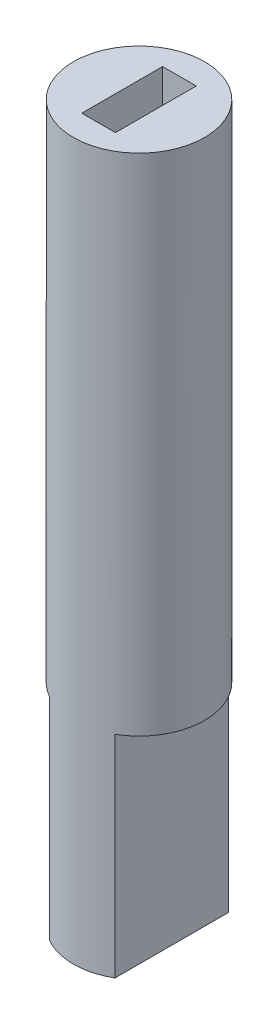
ISO-10303-21;
HEADER;
FILE_DESCRIPTION(('STEP AP214'),'2;1');
FILE_NAME('part.step','',(''),(''),'','','');
FILE_SCHEMA(('AUTOMOTIVE_DESIGN { 1 0 10303 214 1 1 1 1 }'));
ENDSEC;
DATA;
#1=APPLICATION_CONTEXT('core data for automotive mechanical design processes');
#2=APPLICATION_PROTOCOL_DEFINITION('international standard','automotive_design',2000,#1);
#3=PRODUCT_CONTEXT('',#1,'mechanical');
#4=PRODUCT('Part','Part','',(#3));
#5=PRODUCT_RELATED_PRODUCT_CATEGORY('part','',(#4));
#6=PRODUCT_DEFINITION_FORMATION('','',#4);
#7=PRODUCT_DEFINITION_CONTEXT('part definition',#1,'design');
#8=PRODUCT_DEFINITION('design','',#6,#7);
#9=PRODUCT_DEFINITION_SHAPE('','',#8);
#10=(LENGTH_UNIT() NAMED_UNIT(*) SI_UNIT(.MILLI.,.METRE.));
#11=(NAMED_UNIT(*) PLANE_ANGLE_UNIT() SI_UNIT($,.RADIAN.));
#12=(NAMED_UNIT(*) SI_UNIT($,.STERADIAN.) SOLID_ANGLE_UNIT());
#13=UNCERTAINTY_MEASURE_WITH_UNIT(LENGTH_MEASURE(1.E-05),#10,'distance_accuracy_value','');
#14=(GEOMETRIC_REPRESENTATION_CONTEXT(3) GLOBAL_UNCERTAINTY_ASSIGNED_CONTEXT((#13)) GLOBAL_UNIT_ASSIGNED_CONTEXT((#10,
#11,#12)) REPRESENTATION_CONTEXT('',''));
#15=CARTESIAN_POINT('',(0.,0.,0.));
#16=DIRECTION('',(0.,0.,1.));
#17=DIRECTION('',(1.,0.,0.));
#18=AXIS2_PLACEMENT_3D('',#15,#16,#17);
#19=CARTESIAN_POINT('',(0.,130.1,0.));
#20=DIRECTION('',(0.,1.,0.));
#21=DIRECTION('',(0.,0.,1.));
#22=AXIS2_PLACEMENT_3D('',#19,#20,#21);
#23=PLANE('',#22);
#24=DIRECTION('',(0.,0.,-1.));
#25=VECTOR('',#24,1.);
#26=CARTESIAN_POINT('',(-0.5000000000001,130.1,48.8000000000001));
#27=LINE('',#26,#25);
#28=CARTESIAN_POINT('',(-0.500000000000099,130.1,51.2000000000001));
#29=VERTEX_POINT('',#28);
#30=CARTESIAN_POINT('',(-0.5000000000001,130.1,48.8000000000001));
#31=VERTEX_POINT('',#30);
#32=EDGE_CURVE('E139',#29,#31,#27,.T.);
#33=ORIENTED_EDGE('',*,*,#32,.T.);
#34=DIRECTION('',(1.,0.,0.));
#35=VECTOR('',#34,1.);
#36=CARTESIAN_POINT('',(-0.5000000000001,130.1,48.8000000000001));
#37=LINE('',#36,#35);
#38=CARTESIAN_POINT('',(0.4999999999999,130.1,48.8000000000001));
#39=VERTEX_POINT('',#38);
#40=EDGE_CURVE('E136',#31,#39,#37,.T.);
#41=ORIENTED_EDGE('',*,*,#40,.T.);
#42=DIRECTION('',(0.,0.,1.));
#43=VECTOR('',#42,1.);
#44=CARTESIAN_POINT('',(0.4999999999999,130.1,48.8000000000001));
#45=LINE('',#44,#43);
#46=CARTESIAN_POINT('',(0.499999999999901,130.1,51.2000000000001));
#47=VERTEX_POINT('',#46);
#48=EDGE_CURVE('E63',#39,#47,#45,.T.);
#49=ORIENTED_EDGE('',*,*,#48,.T.);
#50=DIRECTION('',(-1.,0.,0.));
#51=VECTOR('',#50,1.);
#52=CARTESIAN_POINT('',(-0.500000000000099,130.1,51.2000000000001));
#53=LINE('',#52,#51);
#54=EDGE_CURVE('E160',#47,#29,#53,.T.);
#55=ORIENTED_EDGE('',*,*,#54,.T.);
#56=EDGE_LOOP('',(#33,#41,#49,#55));
#57=FACE_BOUND('',#56,.T.);
#58=CARTESIAN_POINT('',(0.,130.1,50.));
#59=DIRECTION('',(0.,1.,0.));
#60=DIRECTION('',(0.,0.,1.));
#61=AXIS2_PLACEMENT_3D('',#58,#59,#60);
#62=CIRCLE('',#61,1.95);
#63=CARTESIAN_POINT('',(0.,130.1,51.95));
#64=VERTEX_POINT('',#63);
#65=EDGE_CURVE('E117',#64,#64,#62,.T.);
#66=ORIENTED_EDGE('',*,*,#65,.T.);
#67=EDGE_LOOP('',(#66));
#68=FACE_BOUND('',#67,.T.);
#69=ADVANCED_FACE('F40',(#57,#68),#23,.T.);
#70=CARTESIAN_POINT('',(0.,120.1,0.));
#71=DIRECTION('',(0.,1.,0.));
#72=DIRECTION('',(0.,0.,1.));
#73=AXIS2_PLACEMENT_3D('',#70,#71,#72);
#74=PLANE('',#73);
#75=DIRECTION('',(0.,0.,1.));
#76=VECTOR('',#75,1.);
#77=CARTESIAN_POINT('',(-0.5000000000001,120.1,48.8000000000001));
#78=LINE('',#77,#76);
#79=CARTESIAN_POINT('',(-0.5000000000001,120.1,48.8000000000001));
#80=VERTEX_POINT('',#79);
#81=CARTESIAN_POINT('',(-0.500000000000099,120.1,51.2000000000001));
#82=VERTEX_POINT('',#81);
#83=EDGE_CURVE('E142',#80,#82,#78,.T.);
#84=ORIENTED_EDGE('',*,*,#83,.T.);
#85=DIRECTION('',(1.,0.,0.));
#86=VECTOR('',#85,1.);
#87=CARTESIAN_POINT('',(-0.500000000000099,120.1,51.2000000000001));
#88=LINE('',#87,#86);
#89=CARTESIAN_POINT('',(0.499999999999901,120.1,51.2000000000001));
#90=VERTEX_POINT('',#89);
#91=EDGE_CURVE('E168',#82,#90,#88,.T.);
#92=ORIENTED_EDGE('',*,*,#91,.T.);
#93=DIRECTION('',(0.,0.,-1.));
#94=VECTOR('',#93,1.);
#95=CARTESIAN_POINT('',(0.4999999999999,120.1,48.8000000000001));
#96=LINE('',#95,#94);
#97=CARTESIAN_POINT('',(0.4999999999999,120.1,48.8000000000001));
#98=VERTEX_POINT('',#97);
#99=EDGE_CURVE('E164',#90,#98,#96,.T.);
#100=ORIENTED_EDGE('',*,*,#99,.T.);
#101=DIRECTION('',(-1.,0.,0.));
#102=VECTOR('',#101,1.);
#103=CARTESIAN_POINT('',(-0.5000000000001,120.1,48.8000000000001));
#104=LINE('',#103,#102);
#105=EDGE_CURVE('E148',#98,#80,#104,.T.);
#106=ORIENTED_EDGE('',*,*,#105,.T.);
#107=EDGE_LOOP('',(#84,#92,#100,#106));
#108=FACE_BOUND('',#107,.T.);
#109=ADVANCED_FACE('F42',(#108),#74,.T.);
#110=CARTESIAN_POINT('',(-0.500000000000099,120.1,51.2000000000001));
#111=DIRECTION('',(0.,0.,1.));
#112=DIRECTION('',(1.,0.,0.));
#113=AXIS2_PLACEMENT_3D('',#110,#111,#112);
#114=PLANE('',#113);
#115=ORIENTED_EDGE('',*,*,#54,.F.);
#116=DIRECTION('',(0.,1.,0.));
#117=VECTOR('',#116,1.);
#118=CARTESIAN_POINT('',(0.499999999999901,120.1,51.2000000000001));
#119=LINE('',#118,#117);
#120=EDGE_CURVE('E147',#90,#47,#119,.T.);
#121=ORIENTED_EDGE('',*,*,#120,.F.);
#122=ORIENTED_EDGE('',*,*,#91,.F.);
#123=DIRECTION('',(0.,1.,0.));
#124=VECTOR('',#123,1.);
#125=CARTESIAN_POINT('',(-0.500000000000099,120.1,51.2000000000001));
#126=LINE('',#125,#124);
#127=EDGE_CURVE('E143',#82,#29,#126,.T.);
#128=ORIENTED_EDGE('',*,*,#127,.T.);
#129=EDGE_LOOP('',(#115,#121,#122,#128));
#130=FACE_BOUND('',#129,.T.);
#131=ADVANCED_FACE('F222',(#130),#114,.F.);
#132=CARTESIAN_POINT('',(0.4999999999999,120.1,48.8000000000001));
#133=DIRECTION('',(1.,0.,0.));
#134=DIRECTION('',(0.,0.,-1.));
#135=AXIS2_PLACEMENT_3D('',#132,#133,#134);
#136=PLANE('',#135);
#137=ORIENTED_EDGE('',*,*,#48,.F.);
#138=DIRECTION('',(0.,1.,0.));
#139=VECTOR('',#138,1.);
#140=CARTESIAN_POINT('',(0.4999999999999,120.1,48.8000000000001));
#141=LINE('',#140,#139);
#142=EDGE_CURVE('E152',#98,#39,#141,.T.);
#143=ORIENTED_EDGE('',*,*,#142,.F.);
#144=ORIENTED_EDGE('',*,*,#99,.F.);
#145=ORIENTED_EDGE('',*,*,#120,.T.);
#146=EDGE_LOOP('',(#137,#143,#144,#145));
#147=FACE_BOUND('',#146,.T.);
#148=ADVANCED_FACE('F232',(#147),#136,.F.);
#149=CARTESIAN_POINT('',(-0.5000000000001,120.1,48.8000000000001));
#150=DIRECTION('',(0.,0.,-1.));
#151=DIRECTION('',(-1.,0.,0.));
#152=AXIS2_PLACEMENT_3D('',#149,#150,#151);
#153=PLANE('',#152);
#154=ORIENTED_EDGE('',*,*,#40,.F.);
#155=DIRECTION('',(0.,1.,0.));
#156=VECTOR('',#155,1.);
#157=CARTESIAN_POINT('',(-0.5000000000001,120.1,48.8000000000001));
#158=LINE('',#157,#156);
#159=EDGE_CURVE('E156',#80,#31,#158,.T.);
#160=ORIENTED_EDGE('',*,*,#159,.F.);
#161=ORIENTED_EDGE('',*,*,#105,.F.);
#162=ORIENTED_EDGE('',*,*,#142,.T.);
#163=EDGE_LOOP('',(#154,#160,#161,#162));
#164=FACE_BOUND('',#163,.T.);
#165=ADVANCED_FACE('F213',(#164),#153,.F.);
#166=CARTESIAN_POINT('',(-0.5000000000001,120.1,48.8000000000001));
#167=DIRECTION('',(-1.,0.,0.));
#168=DIRECTION('',(0.,0.,1.));
#169=AXIS2_PLACEMENT_3D('',#166,#167,#168);
#170=PLANE('',#169);
#171=ORIENTED_EDGE('',*,*,#32,.F.);
#172=ORIENTED_EDGE('',*,*,#127,.F.);
#173=ORIENTED_EDGE('',*,*,#83,.F.);
#174=ORIENTED_EDGE('',*,*,#159,.T.);
#175=EDGE_LOOP('',(#171,#172,#173,#174));
#176=FACE_BOUND('',#175,.T.);
#177=ADVANCED_FACE('F204',(#176),#170,.F.);
#178=CARTESIAN_POINT('',(0.,105.1,50.));
#179=DIRECTION('',(0.,1.,0.));
#180=DIRECTION('',(0.,0.,1.));
#181=AXIS2_PLACEMENT_3D('',#178,#179,#180);
#182=CYLINDRICAL_SURFACE('',#181,1.95);
#183=DIRECTION('',(0.,1.,0.));
#184=VECTOR('',#183,1.);
#185=CARTESIAN_POINT('',(-0.975000000000099,105.1,51.6887495373796));
#186=LINE('',#185,#184);
#187=CARTESIAN_POINT('',(-0.975000000000099,115.1,51.6887495373796));
#188=VERTEX_POINT('',#187);
#189=CARTESIAN_POINT('',(-0.975000000000099,108.83,51.6887495373796));
#190=VERTEX_POINT('',#189);
#191=EDGE_CURVE('E189',#188,#190,#186,.F.);
#192=ORIENTED_EDGE('',*,*,#191,.T.);
#193=CARTESIAN_POINT('',(0.,108.83,50.));
#194=DIRECTION('',(0.,-1.,0.));
#195=DIRECTION('',(0.,0.,-1.));
#196=AXIS2_PLACEMENT_3D('',#193,#194,#195);
#197=CIRCLE('',#196,1.95);
#198=CARTESIAN_POINT('',(0.974999999999901,108.83,51.6887495373797));
#199=VERTEX_POINT('',#198);
#200=EDGE_CURVE('E183',#199,#190,#197,.T.);
#201=ORIENTED_EDGE('',*,*,#200,.F.);
#202=DIRECTION('',(0.,1.,0.));
#203=VECTOR('',#202,1.);
#204=CARTESIAN_POINT('',(0.974999999999901,105.1,51.6887495373797));
#205=LINE('',#204,#203);
#206=CARTESIAN_POINT('',(0.9749999999999,115.1,51.6887495373797));
#207=VERTEX_POINT('',#206);
#208=EDGE_CURVE('E56',#199,#207,#205,.T.);
#209=ORIENTED_EDGE('',*,*,#208,.T.);
#210=CARTESIAN_POINT('',(0.,115.1,50.));
#211=DIRECTION('',(0.,-1.,0.));
#212=DIRECTION('',(0.,0.,-1.));
#213=AXIS2_PLACEMENT_3D('',#210,#211,#212);
#214=CIRCLE('',#213,1.95);
#215=CARTESIAN_POINT('',(0.974999999999901,115.1,48.3112504626203));
#216=VERTEX_POINT('',#215);
#217=EDGE_CURVE('E11',#216,#207,#214,.T.);
#218=ORIENTED_EDGE('',*,*,#217,.F.);
#219=DIRECTION('',(0.,1.,0.));
#220=VECTOR('',#219,1.);
#221=CARTESIAN_POINT('',(0.974999999999901,105.1,48.3112504626203));
#222=LINE('',#221,#220);
#223=CARTESIAN_POINT('',(0.974999999999901,108.83,48.3112504626203));
#224=VERTEX_POINT('',#223);
#225=EDGE_CURVE('E105',#216,#224,#222,.F.);
#226=ORIENTED_EDGE('',*,*,#225,.T.);
#227=CARTESIAN_POINT('',(-0.975000000000099,108.83,48.3112504626204));
#228=VERTEX_POINT('',#227);
#229=EDGE_CURVE('E182',#228,#224,#197,.T.);
#230=ORIENTED_EDGE('',*,*,#229,.F.);
#231=DIRECTION('',(0.,1.,0.));
#232=VECTOR('',#231,1.);
#233=CARTESIAN_POINT('',(-0.975000000000099,105.1,48.3112504626204));
#234=LINE('',#233,#232);
#235=CARTESIAN_POINT('',(-0.975000000000099,115.1,48.3112504626204));
#236=VERTEX_POINT('',#235);
#237=EDGE_CURVE('E129',#228,#236,#234,.T.);
#238=ORIENTED_EDGE('',*,*,#237,.T.);
#239=CARTESIAN_POINT('',(0.,115.1,50.));
#240=DIRECTION('',(0.,-1.,0.));
#241=DIRECTION('',(0.,0.,-1.));
#242=AXIS2_PLACEMENT_3D('',#239,#240,#241);
#243=CIRCLE('',#242,1.95);
#244=EDGE_CURVE('E122',#188,#236,#243,.T.);
#245=ORIENTED_EDGE('',*,*,#244,.F.);
#246=EDGE_LOOP('',(#192,#201,#209,#218,#226,#230,#238,#245));
#247=FACE_BOUND('',#246,.T.);
#248=ORIENTED_EDGE('',*,*,#65,.F.);
#249=EDGE_LOOP('',(#248));
#250=FACE_BOUND('',#249,.T.);
#251=ADVANCED_FACE('F103',(#247,#250),#182,.T.);
#252=CARTESIAN_POINT('',(0.,115.1,50.));
#253=DIRECTION('',(0.,-1.,0.));
#254=DIRECTION('',(0.,0.,-1.));
#255=AXIS2_PLACEMENT_3D('',#252,#253,#254);
#256=PLANE('',#255);
#257=DIRECTION('',(0.,0.,-1.));
#258=VECTOR('',#257,1.);
#259=CARTESIAN_POINT('',(0.974999999999901,115.1,48.2537540264899));
#260=LINE('',#259,#258);
#261=EDGE_CURVE('E113',#207,#216,#260,.T.);
#262=ORIENTED_EDGE('',*,*,#261,.T.);
#263=ORIENTED_EDGE('',*,*,#217,.T.);
#264=EDGE_LOOP('',(#262,#263));
#265=FACE_BOUND('',#264,.T.);
#266=ADVANCED_FACE('F119',(#265),#256,.T.);
#267=CARTESIAN_POINT('',(0.,115.1,50.));
#268=DIRECTION('',(0.,-1.,0.));
#269=DIRECTION('',(0.,0.,-1.));
#270=AXIS2_PLACEMENT_3D('',#267,#268,#269);
#271=PLANE('',#270);
#272=DIRECTION('',(0.,0.,1.));
#273=VECTOR('',#272,1.);
#274=CARTESIAN_POINT('',(-0.975000000000098,115.1,51.74624597351));
#275=LINE('',#274,#273);
#276=EDGE_CURVE('E121',#236,#188,#275,.T.);
#277=ORIENTED_EDGE('',*,*,#276,.T.);
#278=ORIENTED_EDGE('',*,*,#244,.T.);
#279=EDGE_LOOP('',(#277,#278));
#280=FACE_BOUND('',#279,.T.);
#281=ADVANCED_FACE('F210',(#280),#271,.T.);
#282=CARTESIAN_POINT('',(0.,108.83,0.));
#283=DIRECTION('',(0.,-1.,0.));
#284=DIRECTION('',(0.,0.,-1.));
#285=AXIS2_PLACEMENT_3D('',#282,#283,#284);
#286=PLANE('',#285);
#287=DIRECTION('',(0.,0.,1.));
#288=VECTOR('',#287,1.);
#289=CARTESIAN_POINT('',(0.974999999999901,108.83,48.2537540264899));
#290=LINE('',#289,#288);
#291=EDGE_CURVE('E115',#224,#199,#290,.T.);
#292=ORIENTED_EDGE('',*,*,#291,.T.);
#293=ORIENTED_EDGE('',*,*,#200,.T.);
#294=DIRECTION('',(0.,0.,-1.));
#295=VECTOR('',#294,1.);
#296=CARTESIAN_POINT('',(-0.975000000000099,108.83,51.74624597351));
#297=LINE('',#296,#295);
#298=EDGE_CURVE('E49',#190,#228,#297,.T.);
#299=ORIENTED_EDGE('',*,*,#298,.T.);
#300=ORIENTED_EDGE('',*,*,#229,.T.);
#301=EDGE_LOOP('',(#292,#293,#299,#300));
#302=FACE_BOUND('',#301,.T.);
#303=ADVANCED_FACE('F181',(#302),#286,.T.);
#304=CARTESIAN_POINT('',(-0.975000000000099,75.1,51.74624597351));
#305=DIRECTION('',(1.,0.,0.));
#306=DIRECTION('',(0.,0.,-1.));
#307=AXIS2_PLACEMENT_3D('',#304,#305,#306);
#308=PLANE('',#307);
#309=ORIENTED_EDGE('',*,*,#237,.F.);
#310=ORIENTED_EDGE('',*,*,#298,.F.);
#311=ORIENTED_EDGE('',*,*,#191,.F.);
#312=ORIENTED_EDGE('',*,*,#276,.F.);
#313=EDGE_LOOP('',(#309,#310,#311,#312));
#314=FACE_BOUND('',#313,.T.);
#315=ADVANCED_FACE('F187',(#314),#308,.F.);
#316=CARTESIAN_POINT('',(0.974999999999901,75.1,48.2537540264899));
#317=DIRECTION('',(-1.,0.,0.));
#318=DIRECTION('',(0.,0.,1.));
#319=AXIS2_PLACEMENT_3D('',#316,#317,#318);
#320=PLANE('',#319);
#321=ORIENTED_EDGE('',*,*,#208,.F.);
#322=ORIENTED_EDGE('',*,*,#291,.F.);
#323=ORIENTED_EDGE('',*,*,#225,.F.);
#324=ORIENTED_EDGE('',*,*,#261,.F.);
#325=EDGE_LOOP('',(#321,#322,#323,#324));
#326=FACE_BOUND('',#325,.T.);
#327=ADVANCED_FACE('F112',(#326),#320,.F.);
#328=CLOSED_SHELL('',(#69,#109,#131,#148,#165,#177,#251,#266,#281,#303,#315,#327));
#329=MANIFOLD_SOLID_BREP('B2',#328);
#330=ADVANCED_BREP_SHAPE_REPRESENTATION('',(#18,#329),#14);
#331=SHAPE_DEFINITION_REPRESENTATION(#9,#330);
ENDSEC;
END-ISO-10303-21;
